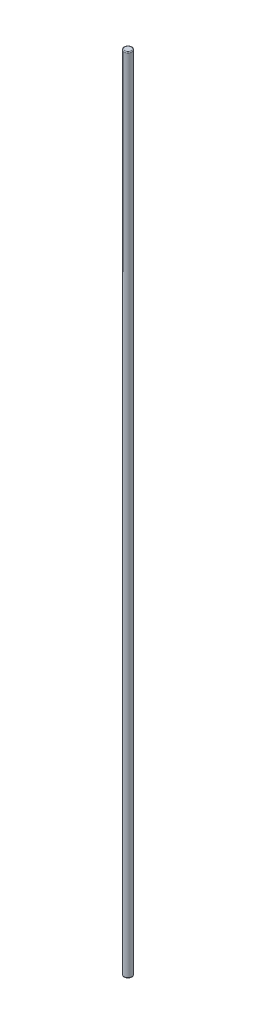
ISO-10303-21;
HEADER;
FILE_DESCRIPTION(('STEP AP214'),'2;1');
FILE_NAME('part.step','',(''),(''),'','','');
FILE_SCHEMA(('AUTOMOTIVE_DESIGN { 1 0 10303 214 1 1 1 1 }'));
ENDSEC;
DATA;
#1=APPLICATION_CONTEXT('core data for automotive mechanical design processes');
#2=APPLICATION_PROTOCOL_DEFINITION('international standard','automotive_design',2000,#1);
#3=PRODUCT_CONTEXT('',#1,'mechanical');
#4=PRODUCT('Part','Part','',(#3));
#5=PRODUCT_RELATED_PRODUCT_CATEGORY('part','',(#4));
#6=PRODUCT_DEFINITION_FORMATION('','',#4);
#7=PRODUCT_DEFINITION_CONTEXT('part definition',#1,'design');
#8=PRODUCT_DEFINITION('design','',#6,#7);
#9=PRODUCT_DEFINITION_SHAPE('','',#8);
#10=(LENGTH_UNIT() NAMED_UNIT(*) SI_UNIT(.MILLI.,.METRE.));
#11=(NAMED_UNIT(*) PLANE_ANGLE_UNIT() SI_UNIT($,.RADIAN.));
#12=(NAMED_UNIT(*) SI_UNIT($,.STERADIAN.) SOLID_ANGLE_UNIT());
#13=UNCERTAINTY_MEASURE_WITH_UNIT(LENGTH_MEASURE(1.E-05),#10,'distance_accuracy_value','');
#14=(GEOMETRIC_REPRESENTATION_CONTEXT(3) GLOBAL_UNCERTAINTY_ASSIGNED_CONTEXT((#13)) GLOBAL_UNIT_ASSIGNED_CONTEXT((#10,
#11,#12)) REPRESENTATION_CONTEXT('',''));
#15=CARTESIAN_POINT('',(0.,0.,0.));
#16=DIRECTION('',(0.,0.,1.));
#17=DIRECTION('',(1.,0.,0.));
#18=AXIS2_PLACEMENT_3D('',#15,#16,#17);
#19=CARTESIAN_POINT('',(0.,200.,0.));
#20=DIRECTION('',(0.,-1.,0.));
#21=DIRECTION('',(0.,0.,-1.));
#22=AXIS2_PLACEMENT_3D('',#19,#20,#21);
#23=CYLINDRICAL_SURFACE('',#22,1.);
#24=CARTESIAN_POINT('',(0.,199.8,0.));
#25=DIRECTION('',(0.,1.,0.));
#26=DIRECTION('',(0.,0.,1.));
#27=AXIS2_PLACEMENT_3D('',#24,#25,#26);
#28=CIRCLE('',#27,1.);
#29=CARTESIAN_POINT('',(0.,199.8,1.));
#30=VERTEX_POINT('',#29);
#31=EDGE_CURVE('E42',#30,#30,#28,.F.);
#32=ORIENTED_EDGE('',*,*,#31,.T.);
#33=EDGE_LOOP('',(#32));
#34=FACE_BOUND('',#33,.T.);
#35=CARTESIAN_POINT('',(0.,0.200000000000006,0.));
#36=DIRECTION('',(0.,1.,0.));
#37=DIRECTION('',(0.,0.,1.));
#38=AXIS2_PLACEMENT_3D('',#35,#36,#37);
#39=CIRCLE('',#38,1.);
#40=CARTESIAN_POINT('',(0.,0.200000000000006,1.));
#41=VERTEX_POINT('',#40);
#42=EDGE_CURVE('E46',#41,#41,#39,.T.);
#43=ORIENTED_EDGE('',*,*,#42,.T.);
#44=EDGE_LOOP('',(#43));
#45=FACE_BOUND('',#44,.T.);
#46=ADVANCED_FACE('F35',(#34,#45),#23,.T.);
#47=CARTESIAN_POINT('',(0.,200.,0.));
#48=DIRECTION('',(0.,1.,0.));
#49=DIRECTION('',(0.,0.,1.));
#50=AXIS2_PLACEMENT_3D('',#47,#48,#49);
#51=PLANE('',#50);
#52=CARTESIAN_POINT('',(0.,200.,0.));
#53=DIRECTION('',(0.,1.,0.));
#54=DIRECTION('',(0.,0.,1.));
#55=AXIS2_PLACEMENT_3D('',#52,#53,#54);
#56=CIRCLE('',#55,0.8);
#57=CARTESIAN_POINT('',(0.,200.,0.8));
#58=VERTEX_POINT('',#57);
#59=EDGE_CURVE('E50',#58,#58,#56,.T.);
#60=ORIENTED_EDGE('',*,*,#59,.T.);
#61=EDGE_LOOP('',(#60));
#62=FACE_BOUND('',#61,.T.);
#63=ADVANCED_FACE('F56',(#62),#51,.T.);
#64=CARTESIAN_POINT('',(0.,0.,0.));
#65=DIRECTION('',(0.,1.,0.));
#66=DIRECTION('',(0.,0.,1.));
#67=AXIS2_PLACEMENT_3D('',#64,#65,#66);
#68=PLANE('',#67);
#69=CARTESIAN_POINT('',(0.,0.,0.));
#70=DIRECTION('',(0.,1.,0.));
#71=DIRECTION('',(0.,0.,1.));
#72=AXIS2_PLACEMENT_3D('',#69,#70,#71);
#73=CIRCLE('',#72,0.8);
#74=CARTESIAN_POINT('',(0.,0.,0.8));
#75=VERTEX_POINT('',#74);
#76=EDGE_CURVE('E10',#75,#75,#73,.F.);
#77=ORIENTED_EDGE('',*,*,#76,.T.);
#78=EDGE_LOOP('',(#77));
#79=FACE_BOUND('',#78,.T.);
#80=ADVANCED_FACE('F60',(#79),#68,.F.);
#81=CARTESIAN_POINT('',(0.,199.8,0.));
#82=DIRECTION('',(0.,1.,0.));
#83=DIRECTION('',(0.,0.,1.));
#84=AXIS2_PLACEMENT_3D('',#81,#82,#83);
#85=TOROIDAL_SURFACE('',#84,0.8,0.2);
#86=ORIENTED_EDGE('',*,*,#31,.F.);
#87=EDGE_LOOP('',(#86));
#88=FACE_BOUND('',#87,.T.);
#89=ORIENTED_EDGE('',*,*,#59,.F.);
#90=EDGE_LOOP('',(#89));
#91=FACE_BOUND('',#90,.T.);
#92=ADVANCED_FACE('F58',(#88,#91),#85,.T.);
#93=CARTESIAN_POINT('',(0.,0.200000000000006,0.));
#94=DIRECTION('',(0.,1.,0.));
#95=DIRECTION('',(0.,0.,1.));
#96=AXIS2_PLACEMENT_3D('',#93,#94,#95);
#97=TOROIDAL_SURFACE('',#96,0.8,0.2);
#98=ORIENTED_EDGE('',*,*,#76,.F.);
#99=EDGE_LOOP('',(#98));
#100=FACE_BOUND('',#99,.T.);
#101=ORIENTED_EDGE('',*,*,#42,.F.);
#102=EDGE_LOOP('',(#101));
#103=FACE_BOUND('',#102,.T.);
#104=ADVANCED_FACE('F37',(#100,#103),#97,.T.);
#105=CLOSED_SHELL('',(#46,#63,#80,#92,#104));
#106=MANIFOLD_SOLID_BREP('B2',#105);
#107=ADVANCED_BREP_SHAPE_REPRESENTATION('',(#18,#106),#14);
#108=SHAPE_DEFINITION_REPRESENTATION(#9,#107);
ENDSEC;
END-ISO-10303-21;
